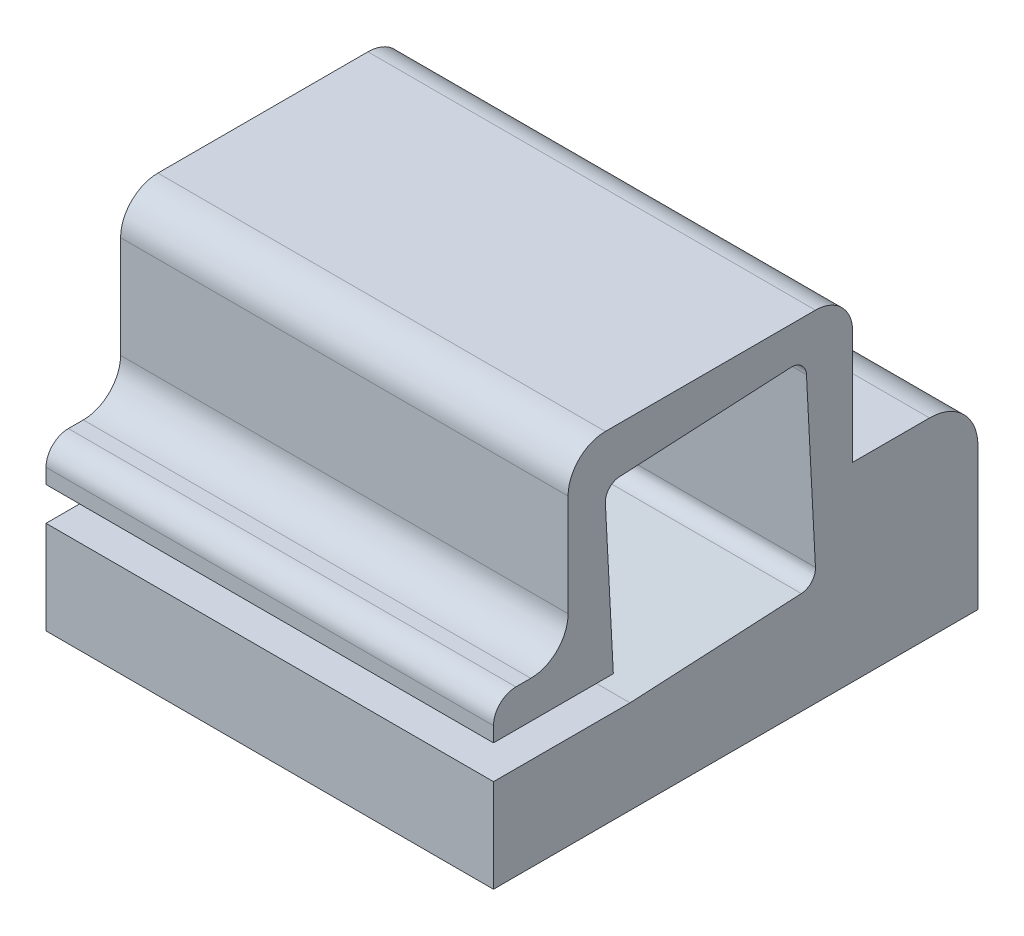
ISO-10303-21;
HEADER;
FILE_DESCRIPTION(('STEP AP214'),'2;1');
FILE_NAME('part.step','',(''),(''),'','','');
FILE_SCHEMA(('AUTOMOTIVE_DESIGN { 1 0 10303 214 1 1 1 1 }'));
ENDSEC;
DATA;
#1=APPLICATION_CONTEXT('core data for automotive mechanical design processes');
#2=APPLICATION_PROTOCOL_DEFINITION('international standard','automotive_design',2000,#1);
#3=PRODUCT_CONTEXT('',#1,'mechanical');
#4=PRODUCT('Part','Part','',(#3));
#5=PRODUCT_RELATED_PRODUCT_CATEGORY('part','',(#4));
#6=PRODUCT_DEFINITION_FORMATION('','',#4);
#7=PRODUCT_DEFINITION_CONTEXT('part definition',#1,'design');
#8=PRODUCT_DEFINITION('design','',#6,#7);
#9=PRODUCT_DEFINITION_SHAPE('','',#8);
#10=(LENGTH_UNIT() NAMED_UNIT(*) SI_UNIT(.MILLI.,.METRE.));
#11=(NAMED_UNIT(*) PLANE_ANGLE_UNIT() SI_UNIT($,.RADIAN.));
#12=(NAMED_UNIT(*) SI_UNIT($,.STERADIAN.) SOLID_ANGLE_UNIT());
#13=UNCERTAINTY_MEASURE_WITH_UNIT(LENGTH_MEASURE(1.E-05),#10,'distance_accuracy_value','');
#14=(GEOMETRIC_REPRESENTATION_CONTEXT(3) GLOBAL_UNCERTAINTY_ASSIGNED_CONTEXT((#13)) GLOBAL_UNIT_ASSIGNED_CONTEXT((#10,
#11,#12)) REPRESENTATION_CONTEXT('',''));
#15=CARTESIAN_POINT('',(0.,0.,0.));
#16=DIRECTION('',(0.,0.,1.));
#17=DIRECTION('',(1.,0.,0.));
#18=AXIS2_PLACEMENT_3D('',#15,#16,#17);
#19=CARTESIAN_POINT('',(60.,-26.58,-35.8784534922355));
#20=DIRECTION('',(0.,1.,0.));
#21=DIRECTION('',(0.,0.,1.));
#22=AXIS2_PLACEMENT_3D('',#19,#20,#21);
#23=PLANE('',#22);
#24=DIRECTION('',(0.,0.,-1.));
#25=VECTOR('',#24,1.);
#26=CARTESIAN_POINT('',(0.,-26.58,-35.8784534922355));
#27=LINE('',#26,#25);
#28=CARTESIAN_POINT('',(0.,-26.58,29.0833622159806));
#29=VERTEX_POINT('',#28);
#30=CARTESIAN_POINT('',(0.,-26.58,-35.8784534922355));
#31=VERTEX_POINT('',#30);
#32=EDGE_CURVE('E221',#29,#31,#27,.T.);
#33=ORIENTED_EDGE('',*,*,#32,.T.);
#34=DIRECTION('',(-1.,0.,0.));
#35=VECTOR('',#34,1.);
#36=CARTESIAN_POINT('',(60.,-26.58,-35.8784534922355));
#37=LINE('',#36,#35);
#38=CARTESIAN_POINT('',(60.,-26.58,-35.8784534922355));
#39=VERTEX_POINT('',#38);
#40=EDGE_CURVE('E11',#39,#31,#37,.T.);
#41=ORIENTED_EDGE('',*,*,#40,.F.);
#42=DIRECTION('',(0.,0.,-1.));
#43=VECTOR('',#42,1.);
#44=CARTESIAN_POINT('',(60.,-26.58,-35.8784534922355));
#45=LINE('',#44,#43);
#46=CARTESIAN_POINT('',(60.,-26.58,29.0833622159806));
#47=VERTEX_POINT('',#46);
#48=EDGE_CURVE('E265',#47,#39,#45,.T.);
#49=ORIENTED_EDGE('',*,*,#48,.F.);
#50=DIRECTION('',(-1.,0.,0.));
#51=VECTOR('',#50,1.);
#52=CARTESIAN_POINT('',(60.,-26.58,29.0833622159806));
#53=LINE('',#52,#51);
#54=EDGE_CURVE('E217',#47,#29,#53,.T.);
#55=ORIENTED_EDGE('',*,*,#54,.T.);
#56=EDGE_LOOP('',(#33,#41,#49,#55));
#57=FACE_BOUND('',#56,.T.);
#58=ADVANCED_FACE('F35',(#57),#23,.F.);
#59=CARTESIAN_POINT('',(60.,-7.57999999999994,-35.8784534922355));
#60=DIRECTION('',(0.,0.,1.));
#61=DIRECTION('',(1.,0.,0.));
#62=AXIS2_PLACEMENT_3D('',#59,#60,#61);
#63=PLANE('',#62);
#64=DIRECTION('',(0.,1.,0.));
#65=VECTOR('',#64,1.);
#66=CARTESIAN_POINT('',(0.,-7.57999999999994,-35.8784534922355));
#67=LINE('',#66,#65);
#68=CARTESIAN_POINT('',(0.,-7.57999999999994,-35.8784534922355));
#69=VERTEX_POINT('',#68);
#70=EDGE_CURVE('E224',#31,#69,#67,.T.);
#71=ORIENTED_EDGE('',*,*,#70,.T.);
#72=DIRECTION('',(-1.,0.,0.));
#73=VECTOR('',#72,1.);
#74=CARTESIAN_POINT('',(60.,-7.57999999999994,-35.8784534922355));
#75=LINE('',#74,#73);
#76=CARTESIAN_POINT('',(60.,-7.57999999999994,-35.8784534922355));
#77=VERTEX_POINT('',#76);
#78=EDGE_CURVE('E43',#77,#69,#75,.T.);
#79=ORIENTED_EDGE('',*,*,#78,.F.);
#80=DIRECTION('',(0.,1.,0.));
#81=VECTOR('',#80,1.);
#82=CARTESIAN_POINT('',(60.,-7.57999999999994,-35.8784534922355));
#83=LINE('',#82,#81);
#84=EDGE_CURVE('E139',#39,#77,#83,.T.);
#85=ORIENTED_EDGE('',*,*,#84,.F.);
#86=ORIENTED_EDGE('',*,*,#40,.T.);
#87=EDGE_LOOP('',(#71,#79,#85,#86));
#88=FACE_BOUND('',#87,.T.);
#89=ADVANCED_FACE('F398',(#88),#63,.F.);
#90=CARTESIAN_POINT('',(60.,-7.57999999999994,-29.3784534922355));
#91=DIRECTION('',(-1.,0.,0.));
#92=DIRECTION('',(0.,0.,1.));
#93=AXIS2_PLACEMENT_3D('',#90,#91,#92);
#94=CYLINDRICAL_SURFACE('',#93,6.50000000000006);
#95=CARTESIAN_POINT('',(0.,-7.57999999999994,-29.3784534922355));
#96=DIRECTION('',(1.,0.,0.));
#97=DIRECTION('',(0.,0.,1.));
#98=AXIS2_PLACEMENT_3D('',#95,#96,#97);
#99=CIRCLE('',#98,6.50000000000006);
#100=CARTESIAN_POINT('',(0.,-1.07999999999988,-29.3784534922355));
#101=VERTEX_POINT('',#100);
#102=EDGE_CURVE('E226',#69,#101,#99,.T.);
#103=ORIENTED_EDGE('',*,*,#102,.T.);
#104=DIRECTION('',(-1.,0.,0.));
#105=VECTOR('',#104,1.);
#106=CARTESIAN_POINT('',(60.,-1.07999999999988,-29.3784534922355));
#107=LINE('',#106,#105);
#108=CARTESIAN_POINT('',(60.,-1.07999999999988,-29.3784534922355));
#109=VERTEX_POINT('',#108);
#110=EDGE_CURVE('E317',#109,#101,#107,.T.);
#111=ORIENTED_EDGE('',*,*,#110,.F.);
#112=CARTESIAN_POINT('',(60.,-7.57999999999994,-29.3784534922355));
#113=DIRECTION('',(1.,0.,0.));
#114=DIRECTION('',(0.,0.,1.));
#115=AXIS2_PLACEMENT_3D('',#112,#113,#114);
#116=CIRCLE('',#115,6.50000000000006);
#117=EDGE_CURVE('E325',#77,#109,#116,.T.);
#118=ORIENTED_EDGE('',*,*,#117,.F.);
#119=ORIENTED_EDGE('',*,*,#78,.T.);
#120=EDGE_LOOP('',(#103,#111,#118,#119));
#121=FACE_BOUND('',#120,.T.);
#122=ADVANCED_FACE('F323',(#121),#94,.T.);
#123=CARTESIAN_POINT('',(60.,-1.07999999999988,-19.0833622159806));
#124=DIRECTION('',(0.,-1.,0.));
#125=DIRECTION('',(0.,0.,-1.));
#126=AXIS2_PLACEMENT_3D('',#123,#124,#125);
#127=PLANE('',#126);
#128=DIRECTION('',(0.,0.,1.));
#129=VECTOR('',#128,1.);
#130=CARTESIAN_POINT('',(0.,-1.07999999999988,-19.0833622159806));
#131=LINE('',#130,#129);
#132=CARTESIAN_POINT('',(0.,-1.07999999999988,-19.0833622159806));
#133=VERTEX_POINT('',#132);
#134=EDGE_CURVE('E228',#101,#133,#131,.T.);
#135=ORIENTED_EDGE('',*,*,#134,.T.);
#136=DIRECTION('',(-1.,0.,0.));
#137=VECTOR('',#136,1.);
#138=CARTESIAN_POINT('',(60.,-1.07999999999988,-19.0833622159806));
#139=LINE('',#138,#137);
#140=CARTESIAN_POINT('',(60.,-1.07999999999988,-19.0833622159806));
#141=VERTEX_POINT('',#140);
#142=EDGE_CURVE('E314',#141,#133,#139,.T.);
#143=ORIENTED_EDGE('',*,*,#142,.F.);
#144=DIRECTION('',(0.,0.,1.));
#145=VECTOR('',#144,1.);
#146=CARTESIAN_POINT('',(60.,-1.07999999999988,-19.0833622159806));
#147=LINE('',#146,#145);
#148=EDGE_CURVE('E343',#109,#141,#147,.T.);
#149=ORIENTED_EDGE('',*,*,#148,.F.);
#150=ORIENTED_EDGE('',*,*,#110,.T.);
#151=EDGE_LOOP('',(#135,#143,#149,#150));
#152=FACE_BOUND('',#151,.T.);
#153=ADVANCED_FACE('F334',(#152),#127,.F.);
#154=CARTESIAN_POINT('',(60.,14.0833622159806,-19.0833622159806));
#155=DIRECTION('',(0.,0.,1.));
#156=DIRECTION('',(1.,0.,0.));
#157=AXIS2_PLACEMENT_3D('',#154,#155,#156);
#158=PLANE('',#157);
#159=DIRECTION('',(0.,1.,0.));
#160=VECTOR('',#159,1.);
#161=CARTESIAN_POINT('',(0.,14.0833622159806,-19.0833622159806));
#162=LINE('',#161,#160);
#163=CARTESIAN_POINT('',(0.,14.0833622159806,-19.0833622159806));
#164=VERTEX_POINT('',#163);
#165=EDGE_CURVE('E230',#133,#164,#162,.T.);
#166=ORIENTED_EDGE('',*,*,#165,.T.);
#167=DIRECTION('',(-1.,0.,0.));
#168=VECTOR('',#167,1.);
#169=CARTESIAN_POINT('',(60.,14.0833622159806,-19.0833622159806));
#170=LINE('',#169,#168);
#171=CARTESIAN_POINT('',(60.,14.0833622159806,-19.0833622159806));
#172=VERTEX_POINT('',#171);
#173=EDGE_CURVE('E311',#172,#164,#170,.T.);
#174=ORIENTED_EDGE('',*,*,#173,.F.);
#175=DIRECTION('',(0.,1.,0.));
#176=VECTOR('',#175,1.);
#177=CARTESIAN_POINT('',(60.,14.0833622159806,-19.0833622159806));
#178=LINE('',#177,#176);
#179=EDGE_CURVE('E340',#141,#172,#178,.T.);
#180=ORIENTED_EDGE('',*,*,#179,.F.);
#181=ORIENTED_EDGE('',*,*,#142,.T.);
#182=EDGE_LOOP('',(#166,#174,#180,#181));
#183=FACE_BOUND('',#182,.T.);
#184=ADVANCED_FACE('F338',(#183),#158,.F.);
#185=CARTESIAN_POINT('',(60.,14.0833622159806,-14.0833622159806));
#186=DIRECTION('',(-1.,0.,0.));
#187=DIRECTION('',(0.,0.,1.));
#188=AXIS2_PLACEMENT_3D('',#185,#186,#187);
#189=CYLINDRICAL_SURFACE('',#188,5.);
#190=CARTESIAN_POINT('',(0.,14.0833622159806,-14.0833622159806));
#191=DIRECTION('',(1.,0.,0.));
#192=DIRECTION('',(0.,0.,1.));
#193=AXIS2_PLACEMENT_3D('',#190,#191,#192);
#194=CIRCLE('',#193,5.);
#195=CARTESIAN_POINT('',(0.,19.0833622159806,-14.0833622159806));
#196=VERTEX_POINT('',#195);
#197=EDGE_CURVE('E232',#164,#196,#194,.T.);
#198=ORIENTED_EDGE('',*,*,#197,.T.);
#199=DIRECTION('',(-1.,0.,0.));
#200=VECTOR('',#199,1.);
#201=CARTESIAN_POINT('',(60.,19.0833622159806,-14.0833622159806));
#202=LINE('',#201,#200);
#203=CARTESIAN_POINT('',(60.,19.0833622159806,-14.0833622159806));
#204=VERTEX_POINT('',#203);
#205=EDGE_CURVE('E308',#204,#196,#202,.T.);
#206=ORIENTED_EDGE('',*,*,#205,.F.);
#207=CARTESIAN_POINT('',(60.,14.0833622159806,-14.0833622159806));
#208=DIRECTION('',(1.,0.,0.));
#209=DIRECTION('',(0.,0.,1.));
#210=AXIS2_PLACEMENT_3D('',#207,#208,#209);
#211=CIRCLE('',#210,5.);
#212=EDGE_CURVE('E342',#172,#204,#211,.T.);
#213=ORIENTED_EDGE('',*,*,#212,.F.);
#214=ORIENTED_EDGE('',*,*,#173,.T.);
#215=EDGE_LOOP('',(#198,#206,#213,#214));
#216=FACE_BOUND('',#215,.T.);
#217=ADVANCED_FACE('F411',(#216),#189,.T.);
#218=CARTESIAN_POINT('',(60.,19.0833622159806,14.0833622159806));
#219=DIRECTION('',(0.,-1.,0.));
#220=DIRECTION('',(0.,0.,-1.));
#221=AXIS2_PLACEMENT_3D('',#218,#219,#220);
#222=PLANE('',#221);
#223=DIRECTION('',(0.,0.,1.));
#224=VECTOR('',#223,1.);
#225=CARTESIAN_POINT('',(0.,19.0833622159806,14.0833622159806));
#226=LINE('',#225,#224);
#227=CARTESIAN_POINT('',(0.,19.0833622159806,14.0833622159806));
#228=VERTEX_POINT('',#227);
#229=EDGE_CURVE('E234',#196,#228,#226,.T.);
#230=ORIENTED_EDGE('',*,*,#229,.T.);
#231=DIRECTION('',(-1.,0.,0.));
#232=VECTOR('',#231,1.);
#233=CARTESIAN_POINT('',(60.,19.0833622159806,14.0833622159806));
#234=LINE('',#233,#232);
#235=CARTESIAN_POINT('',(60.,19.0833622159806,14.0833622159806));
#236=VERTEX_POINT('',#235);
#237=EDGE_CURVE('E305',#236,#228,#234,.T.);
#238=ORIENTED_EDGE('',*,*,#237,.F.);
#239=DIRECTION('',(0.,0.,1.));
#240=VECTOR('',#239,1.);
#241=CARTESIAN_POINT('',(60.,19.0833622159806,14.0833622159806));
#242=LINE('',#241,#240);
#243=EDGE_CURVE('E345',#204,#236,#242,.T.);
#244=ORIENTED_EDGE('',*,*,#243,.F.);
#245=ORIENTED_EDGE('',*,*,#205,.T.);
#246=EDGE_LOOP('',(#230,#238,#244,#245));
#247=FACE_BOUND('',#246,.T.);
#248=ADVANCED_FACE('F414',(#247),#222,.F.);
#249=CARTESIAN_POINT('',(60.,14.0833622159806,14.0833622159806));
#250=DIRECTION('',(-1.,0.,0.));
#251=DIRECTION('',(0.,0.,1.));
#252=AXIS2_PLACEMENT_3D('',#249,#250,#251);
#253=CYLINDRICAL_SURFACE('',#252,5.);
#254=CARTESIAN_POINT('',(0.,14.0833622159806,14.0833622159806));
#255=DIRECTION('',(1.,0.,0.));
#256=DIRECTION('',(0.,0.,-1.));
#257=AXIS2_PLACEMENT_3D('',#254,#255,#256);
#258=CIRCLE('',#257,5.);
#259=CARTESIAN_POINT('',(0.,14.0833622159806,19.0833622159806));
#260=VERTEX_POINT('',#259);
#261=EDGE_CURVE('E236',#228,#260,#258,.T.);
#262=ORIENTED_EDGE('',*,*,#261,.T.);
#263=DIRECTION('',(-1.,0.,0.));
#264=VECTOR('',#263,1.);
#265=CARTESIAN_POINT('',(60.,14.0833622159806,19.0833622159806));
#266=LINE('',#265,#264);
#267=CARTESIAN_POINT('',(60.,14.0833622159806,19.0833622159806));
#268=VERTEX_POINT('',#267);
#269=EDGE_CURVE('E302',#268,#260,#266,.T.);
#270=ORIENTED_EDGE('',*,*,#269,.F.);
#271=CARTESIAN_POINT('',(60.,14.0833622159806,14.0833622159806));
#272=DIRECTION('',(1.,0.,0.));
#273=DIRECTION('',(0.,0.,-1.));
#274=AXIS2_PLACEMENT_3D('',#271,#272,#273);
#275=CIRCLE('',#274,5.);
#276=EDGE_CURVE('E351',#236,#268,#275,.T.);
#277=ORIENTED_EDGE('',*,*,#276,.F.);
#278=ORIENTED_EDGE('',*,*,#237,.T.);
#279=EDGE_LOOP('',(#262,#270,#277,#278));
#280=FACE_BOUND('',#279,.T.);
#281=ADVANCED_FACE('F418',(#280),#253,.T.);
#282=CARTESIAN_POINT('',(60.,0.420000000000007,19.0833622159806));
#283=DIRECTION('',(0.,0.,-1.));
#284=DIRECTION('',(-1.,0.,0.));
#285=AXIS2_PLACEMENT_3D('',#282,#283,#284);
#286=PLANE('',#285);
#287=DIRECTION('',(0.,-1.,0.));
#288=VECTOR('',#287,1.);
#289=CARTESIAN_POINT('',(0.,0.420000000000007,19.0833622159806));
#290=LINE('',#289,#288);
#291=CARTESIAN_POINT('',(0.,0.420000000000007,19.0833622159806));
#292=VERTEX_POINT('',#291);
#293=EDGE_CURVE('E238',#260,#292,#290,.T.);
#294=ORIENTED_EDGE('',*,*,#293,.T.);
#295=DIRECTION('',(-1.,0.,0.));
#296=VECTOR('',#295,1.);
#297=CARTESIAN_POINT('',(60.,0.420000000000007,19.0833622159806));
#298=LINE('',#297,#296);
#299=CARTESIAN_POINT('',(60.,0.420000000000007,19.0833622159806));
#300=VERTEX_POINT('',#299);
#301=EDGE_CURVE('E299',#300,#292,#298,.T.);
#302=ORIENTED_EDGE('',*,*,#301,.F.);
#303=DIRECTION('',(0.,-1.,0.));
#304=VECTOR('',#303,1.);
#305=CARTESIAN_POINT('',(60.,0.420000000000007,19.0833622159806));
#306=LINE('',#305,#304);
#307=EDGE_CURVE('E353',#268,#300,#306,.T.);
#308=ORIENTED_EDGE('',*,*,#307,.F.);
#309=ORIENTED_EDGE('',*,*,#269,.T.);
#310=EDGE_LOOP('',(#294,#302,#308,#309));
#311=FACE_BOUND('',#310,.T.);
#312=ADVANCED_FACE('F422',(#311),#286,.F.);
#313=CARTESIAN_POINT('',(60.,0.420000000000005,24.0833622159806));
#314=DIRECTION('',(-1.,0.,0.));
#315=DIRECTION('',(0.,0.,1.));
#316=AXIS2_PLACEMENT_3D('',#313,#314,#315);
#317=CYLINDRICAL_SURFACE('',#316,5.);
#318=CARTESIAN_POINT('',(0.,0.420000000000005,24.0833622159806));
#319=DIRECTION('',(-1.,0.,0.));
#320=DIRECTION('',(0.,0.,-1.));
#321=AXIS2_PLACEMENT_3D('',#318,#319,#320);
#322=CIRCLE('',#321,5.);
#323=CARTESIAN_POINT('',(0.,-4.58,24.0833622159806));
#324=VERTEX_POINT('',#323);
#325=EDGE_CURVE('E240',#292,#324,#322,.T.);
#326=ORIENTED_EDGE('',*,*,#325,.T.);
#327=DIRECTION('',(-1.,0.,0.));
#328=VECTOR('',#327,1.);
#329=CARTESIAN_POINT('',(60.,-4.58,24.0833622159806));
#330=LINE('',#329,#328);
#331=CARTESIAN_POINT('',(60.,-4.58,24.0833622159806));
#332=VERTEX_POINT('',#331);
#333=EDGE_CURVE('E296',#332,#324,#330,.T.);
#334=ORIENTED_EDGE('',*,*,#333,.F.);
#335=CARTESIAN_POINT('',(60.,0.420000000000005,24.0833622159806));
#336=DIRECTION('',(-1.,0.,0.));
#337=DIRECTION('',(0.,0.,-1.));
#338=AXIS2_PLACEMENT_3D('',#335,#336,#337);
#339=CIRCLE('',#338,5.);
#340=EDGE_CURVE('E355',#300,#332,#339,.T.);
#341=ORIENTED_EDGE('',*,*,#340,.F.);
#342=ORIENTED_EDGE('',*,*,#301,.T.);
#343=EDGE_LOOP('',(#326,#334,#341,#342));
#344=FACE_BOUND('',#343,.T.);
#345=ADVANCED_FACE('F426',(#344),#317,.F.);
#346=CARTESIAN_POINT('',(60.,-4.57999999999999,24.0833622159806));
#347=DIRECTION('',(0.,-1.,0.));
#348=DIRECTION('',(0.,0.,-1.));
#349=AXIS2_PLACEMENT_3D('',#346,#347,#348);
#350=PLANE('',#349);
#351=DIRECTION('',(0.,0.,1.));
#352=VECTOR('',#351,1.);
#353=CARTESIAN_POINT('',(0.,-4.57999999999999,24.0833622159806));
#354=LINE('',#353,#352);
#355=CARTESIAN_POINT('',(0.,-4.58,26.0833622159806));
#356=VERTEX_POINT('',#355);
#357=EDGE_CURVE('E242',#324,#356,#354,.T.);
#358=ORIENTED_EDGE('',*,*,#357,.T.);
#359=DIRECTION('',(-1.,0.,0.));
#360=VECTOR('',#359,1.);
#361=CARTESIAN_POINT('',(60.,-4.58,26.0833622159806));
#362=LINE('',#361,#360);
#363=CARTESIAN_POINT('',(60.,-4.58,26.0833622159806));
#364=VERTEX_POINT('',#363);
#365=EDGE_CURVE('E293',#364,#356,#362,.T.);
#366=ORIENTED_EDGE('',*,*,#365,.F.);
#367=DIRECTION('',(0.,0.,1.));
#368=VECTOR('',#367,1.);
#369=CARTESIAN_POINT('',(60.,-4.57999999999999,24.0833622159806));
#370=LINE('',#369,#368);
#371=EDGE_CURVE('E357',#332,#364,#370,.T.);
#372=ORIENTED_EDGE('',*,*,#371,.F.);
#373=ORIENTED_EDGE('',*,*,#333,.T.);
#374=EDGE_LOOP('',(#358,#366,#372,#373));
#375=FACE_BOUND('',#374,.T.);
#376=ADVANCED_FACE('F430',(#375),#350,.F.);
#377=CARTESIAN_POINT('',(60.,-7.57999999999999,26.0833622159806));
#378=DIRECTION('',(-1.,0.,0.));
#379=DIRECTION('',(0.,0.,1.));
#380=AXIS2_PLACEMENT_3D('',#377,#378,#379);
#381=CYLINDRICAL_SURFACE('',#380,3.);
#382=CARTESIAN_POINT('',(0.,-7.57999999999999,26.0833622159806));
#383=DIRECTION('',(1.,0.,0.));
#384=DIRECTION('',(0.,0.,1.));
#385=AXIS2_PLACEMENT_3D('',#382,#383,#384);
#386=CIRCLE('',#385,3.);
#387=CARTESIAN_POINT('',(0.,-7.57999999999999,29.0833622159806));
#388=VERTEX_POINT('',#387);
#389=EDGE_CURVE('E244',#356,#388,#386,.T.);
#390=ORIENTED_EDGE('',*,*,#389,.T.);
#391=DIRECTION('',(-1.,0.,0.));
#392=VECTOR('',#391,1.);
#393=CARTESIAN_POINT('',(60.,-7.57999999999999,29.0833622159806));
#394=LINE('',#393,#392);
#395=CARTESIAN_POINT('',(60.,-7.57999999999999,29.0833622159806));
#396=VERTEX_POINT('',#395);
#397=EDGE_CURVE('E290',#396,#388,#394,.T.);
#398=ORIENTED_EDGE('',*,*,#397,.F.);
#399=CARTESIAN_POINT('',(60.,-7.57999999999999,26.0833622159806));
#400=DIRECTION('',(1.,0.,0.));
#401=DIRECTION('',(0.,0.,1.));
#402=AXIS2_PLACEMENT_3D('',#399,#400,#401);
#403=CIRCLE('',#402,3.);
#404=EDGE_CURVE('E359',#364,#396,#403,.T.);
#405=ORIENTED_EDGE('',*,*,#404,.F.);
#406=ORIENTED_EDGE('',*,*,#365,.T.);
#407=EDGE_LOOP('',(#390,#398,#405,#406));
#408=FACE_BOUND('',#407,.T.);
#409=ADVANCED_FACE('F434',(#408),#381,.T.);
#410=CARTESIAN_POINT('',(60.,-7.57999999999999,29.0833622159806));
#411=DIRECTION('',(0.,0.,-1.));
#412=DIRECTION('',(0.,1.,0.));
#413=AXIS2_PLACEMENT_3D('',#410,#411,#412);
#414=PLANE('',#413);
#415=DIRECTION('',(0.,-1.,0.));
#416=VECTOR('',#415,1.);
#417=CARTESIAN_POINT('',(0.,-7.57999999999999,29.0833622159806));
#418=LINE('',#417,#416);
#419=CARTESIAN_POINT('',(0.,-9.57999999999999,29.0833622159806));
#420=VERTEX_POINT('',#419);
#421=EDGE_CURVE('E246',#388,#420,#418,.T.);
#422=ORIENTED_EDGE('',*,*,#421,.T.);
#423=DIRECTION('',(-1.,0.,0.));
#424=VECTOR('',#423,1.);
#425=CARTESIAN_POINT('',(60.,-9.57999999999999,29.0833622159806));
#426=LINE('',#425,#424);
#427=CARTESIAN_POINT('',(60.,-9.57999999999999,29.0833622159806));
#428=VERTEX_POINT('',#427);
#429=EDGE_CURVE('E287',#428,#420,#426,.T.);
#430=ORIENTED_EDGE('',*,*,#429,.F.);
#431=DIRECTION('',(0.,-1.,0.));
#432=VECTOR('',#431,1.);
#433=CARTESIAN_POINT('',(60.,-7.57999999999999,29.0833622159806));
#434=LINE('',#433,#432);
#435=EDGE_CURVE('E361',#396,#428,#434,.T.);
#436=ORIENTED_EDGE('',*,*,#435,.F.);
#437=ORIENTED_EDGE('',*,*,#397,.T.);
#438=EDGE_LOOP('',(#422,#430,#436,#437));
#439=FACE_BOUND('',#438,.T.);
#440=ADVANCED_FACE('F438',(#439),#414,.F.);
#441=CARTESIAN_POINT('',(60.,-9.57999999999999,29.0833622159806));
#442=DIRECTION('',(0.,1.,0.));
#443=DIRECTION('',(0.,0.,1.));
#444=AXIS2_PLACEMENT_3D('',#441,#442,#443);
#445=PLANE('',#444);
#446=DIRECTION('',(0.,0.,-1.));
#447=VECTOR('',#446,1.);
#448=CARTESIAN_POINT('',(0.,-9.57999999999999,29.0833622159806));
#449=LINE('',#448,#447);
#450=CARTESIAN_POINT('',(0.,-9.57999999999999,13.0164601454404));
#451=VERTEX_POINT('',#450);
#452=EDGE_CURVE('E248',#420,#451,#449,.T.);
#453=ORIENTED_EDGE('',*,*,#452,.T.);
#454=DIRECTION('',(-1.,0.,0.));
#455=VECTOR('',#454,1.);
#456=CARTESIAN_POINT('',(60.,-9.57999999999999,13.0164601454404));
#457=LINE('',#456,#455);
#458=CARTESIAN_POINT('',(60.,-9.57999999999999,13.0164601454404));
#459=VERTEX_POINT('',#458);
#460=EDGE_CURVE('E284',#459,#451,#457,.T.);
#461=ORIENTED_EDGE('',*,*,#460,.F.);
#462=DIRECTION('',(0.,0.,-1.));
#463=VECTOR('',#462,1.);
#464=CARTESIAN_POINT('',(60.,-9.57999999999999,29.0833622159806));
#465=LINE('',#464,#463);
#466=EDGE_CURVE('E363',#428,#459,#465,.T.);
#467=ORIENTED_EDGE('',*,*,#466,.F.);
#468=ORIENTED_EDGE('',*,*,#429,.T.);
#469=EDGE_LOOP('',(#453,#461,#467,#468));
#470=FACE_BOUND('',#469,.T.);
#471=ADVANCED_FACE('F442',(#470),#445,.F.);
#472=CARTESIAN_POINT('',(60.,10.7777042403978,14.0833622159806));
#473=DIRECTION('',(0.,-0.0523359562429441,0.998629534754574));
#474=DIRECTION('',(0.,-0.998629534754574,-0.0523359562429441));
#475=AXIS2_PLACEMENT_3D('',#472,#473,#474);
#476=PLANE('',#475);
#477=DIRECTION('',(0.,0.998629534754574,0.0523359562429441));
#478=VECTOR('',#477,1.);
#479=CARTESIAN_POINT('',(0.,10.7777042403978,14.0833622159806));
#480=LINE('',#479,#478);
#481=CARTESIAN_POINT('',(0.,10.7777042403978,14.0833622159806));
#482=VERTEX_POINT('',#481);
#483=EDGE_CURVE('E250',#451,#482,#480,.T.);
#484=ORIENTED_EDGE('',*,*,#483,.T.);
#485=DIRECTION('',(-1.,0.,0.));
#486=VECTOR('',#485,1.);
#487=CARTESIAN_POINT('',(60.,10.7777042403978,14.0833622159806));
#488=LINE('',#487,#486);
#489=CARTESIAN_POINT('',(60.,10.7777042403978,14.0833622159806));
#490=VERTEX_POINT('',#489);
#491=EDGE_CURVE('E281',#490,#482,#488,.T.);
#492=ORIENTED_EDGE('',*,*,#491,.F.);
#493=DIRECTION('',(0.,0.998629534754574,0.0523359562429441));
#494=VECTOR('',#493,1.);
#495=CARTESIAN_POINT('',(60.,10.7777042403978,14.0833622159806));
#496=LINE('',#495,#494);
#497=EDGE_CURVE('E365',#459,#490,#496,.T.);
#498=ORIENTED_EDGE('',*,*,#497,.F.);
#499=ORIENTED_EDGE('',*,*,#460,.T.);
#500=EDGE_LOOP('',(#484,#492,#498,#499));
#501=FACE_BOUND('',#500,.T.);
#502=ADVANCED_FACE('F446',(#501),#476,.F.);
#503=CARTESIAN_POINT('',(60.,10.8823761528837,12.0861031464715));
#504=DIRECTION('',(-1.,0.,0.));
#505=DIRECTION('',(0.,0.,1.));
#506=AXIS2_PLACEMENT_3D('',#503,#504,#505);
#507=CYLINDRICAL_SURFACE('',#506,2.);
#508=CARTESIAN_POINT('',(0.,10.8823761528837,12.0861031464715));
#509=DIRECTION('',(-1.,0.,0.));
#510=DIRECTION('',(0.,0.,-1.));
#511=AXIS2_PLACEMENT_3D('',#508,#509,#510);
#512=CIRCLE('',#511,2.);
#513=CARTESIAN_POINT('',(0.,12.8796352223929,12.1907750589574));
#514=VERTEX_POINT('',#513);
#515=EDGE_CURVE('E252',#482,#514,#512,.T.);
#516=ORIENTED_EDGE('',*,*,#515,.T.);
#517=DIRECTION('',(-1.,0.,0.));
#518=VECTOR('',#517,1.);
#519=CARTESIAN_POINT('',(60.,12.8796352223929,12.1907750589574));
#520=LINE('',#519,#518);
#521=CARTESIAN_POINT('',(60.,12.8796352223929,12.1907750589574));
#522=VERTEX_POINT('',#521);
#523=EDGE_CURVE('E278',#522,#514,#520,.T.);
#524=ORIENTED_EDGE('',*,*,#523,.F.);
#525=CARTESIAN_POINT('',(60.,10.8823761528837,12.0861031464715));
#526=DIRECTION('',(-1.,0.,0.));
#527=DIRECTION('',(0.,0.,-1.));
#528=AXIS2_PLACEMENT_3D('',#525,#526,#527);
#529=CIRCLE('',#528,2.);
#530=EDGE_CURVE('E367',#490,#522,#529,.T.);
#531=ORIENTED_EDGE('',*,*,#530,.F.);
#532=ORIENTED_EDGE('',*,*,#491,.T.);
#533=EDGE_LOOP('',(#516,#524,#531,#532));
#534=FACE_BOUND('',#533,.T.);
#535=ADVANCED_FACE('F450',(#534),#507,.F.);
#536=CARTESIAN_POINT('',(60.,14.0833622159806,-10.7777042403978));
#537=DIRECTION('',(0.,0.998629534754574,0.052335956242944));
#538=DIRECTION('',(0.,-0.052335956242944,0.998629534754574));
#539=AXIS2_PLACEMENT_3D('',#536,#537,#538);
#540=PLANE('',#539);
#541=DIRECTION('',(0.,0.052335956242944,-0.998629534754574));
#542=VECTOR('',#541,1.);
#543=CARTESIAN_POINT('',(0.,14.0833622159806,-10.7777042403978));
#544=LINE('',#543,#542);
#545=CARTESIAN_POINT('',(0.,14.0833622159806,-10.7777042403978));
#546=VERTEX_POINT('',#545);
#547=EDGE_CURVE('E254',#514,#546,#544,.T.);
#548=ORIENTED_EDGE('',*,*,#547,.T.);
#549=DIRECTION('',(-1.,0.,0.));
#550=VECTOR('',#549,1.);
#551=CARTESIAN_POINT('',(60.,14.0833622159806,-10.7777042403978));
#552=LINE('',#551,#550);
#553=CARTESIAN_POINT('',(60.,14.0833622159806,-10.7777042403978));
#554=VERTEX_POINT('',#553);
#555=EDGE_CURVE('E275',#554,#546,#552,.T.);
#556=ORIENTED_EDGE('',*,*,#555,.F.);
#557=DIRECTION('',(0.,0.052335956242944,-0.998629534754574));
#558=VECTOR('',#557,1.);
#559=CARTESIAN_POINT('',(60.,14.0833622159806,-10.7777042403978));
#560=LINE('',#559,#558);
#561=EDGE_CURVE('E369',#522,#554,#560,.T.);
#562=ORIENTED_EDGE('',*,*,#561,.F.);
#563=ORIENTED_EDGE('',*,*,#523,.T.);
#564=EDGE_LOOP('',(#548,#556,#562,#563));
#565=FACE_BOUND('',#564,.T.);
#566=ADVANCED_FACE('F454',(#565),#540,.F.);
#567=CARTESIAN_POINT('',(60.,12.0861031464714,-10.8823761528837));
#568=DIRECTION('',(-1.,0.,0.));
#569=DIRECTION('',(0.,0.,1.));
#570=AXIS2_PLACEMENT_3D('',#567,#568,#569);
#571=CYLINDRICAL_SURFACE('',#570,2.);
#572=CARTESIAN_POINT('',(0.,12.0861031464714,-10.8823761528837));
#573=DIRECTION('',(-1.,0.,0.));
#574=DIRECTION('',(0.,0.,-1.));
#575=AXIS2_PLACEMENT_3D('',#572,#573,#574);
#576=CIRCLE('',#575,2.);
#577=CARTESIAN_POINT('',(0.,12.1907750589573,-12.8796352223929));
#578=VERTEX_POINT('',#577);
#579=EDGE_CURVE('E256',#546,#578,#576,.T.);
#580=ORIENTED_EDGE('',*,*,#579,.T.);
#581=DIRECTION('',(-1.,0.,0.));
#582=VECTOR('',#581,1.);
#583=CARTESIAN_POINT('',(60.,12.1907750589573,-12.8796352223929));
#584=LINE('',#583,#582);
#585=CARTESIAN_POINT('',(60.,12.1907750589573,-12.8796352223929));
#586=VERTEX_POINT('',#585);
#587=EDGE_CURVE('E272',#586,#578,#584,.T.);
#588=ORIENTED_EDGE('',*,*,#587,.F.);
#589=CARTESIAN_POINT('',(60.,12.0861031464714,-10.8823761528837));
#590=DIRECTION('',(-1.,0.,0.));
#591=DIRECTION('',(0.,0.,-1.));
#592=AXIS2_PLACEMENT_3D('',#589,#590,#591);
#593=CIRCLE('',#592,2.);
#594=EDGE_CURVE('E371',#554,#586,#593,.T.);
#595=ORIENTED_EDGE('',*,*,#594,.F.);
#596=ORIENTED_EDGE('',*,*,#555,.T.);
#597=EDGE_LOOP('',(#580,#588,#595,#596));
#598=FACE_BOUND('',#597,.T.);
#599=ADVANCED_FACE('F458',(#598),#571,.F.);
#600=CARTESIAN_POINT('',(60.,-10.7777042403979,-14.0833622159806));
#601=DIRECTION('',(0.,0.0523359562429441,-0.998629534754574));
#602=DIRECTION('',(0.,0.998629534754574,0.0523359562429441));
#603=AXIS2_PLACEMENT_3D('',#600,#601,#602);
#604=PLANE('',#603);
#605=DIRECTION('',(0.,-0.998629534754574,-0.0523359562429441));
#606=VECTOR('',#605,1.);
#607=CARTESIAN_POINT('',(0.,-10.7777042403979,-14.0833622159806));
#608=LINE('',#607,#606);
#609=CARTESIAN_POINT('',(0.,-10.7777042403979,-14.0833622159806));
#610=VERTEX_POINT('',#609);
#611=EDGE_CURVE('E258',#578,#610,#608,.T.);
#612=ORIENTED_EDGE('',*,*,#611,.T.);
#613=DIRECTION('',(-1.,0.,0.));
#614=VECTOR('',#613,1.);
#615=CARTESIAN_POINT('',(60.,-10.7777042403979,-14.0833622159806));
#616=LINE('',#615,#614);
#617=CARTESIAN_POINT('',(60.,-10.7777042403979,-14.0833622159806));
#618=VERTEX_POINT('',#617);
#619=EDGE_CURVE('E269',#618,#610,#616,.T.);
#620=ORIENTED_EDGE('',*,*,#619,.F.);
#621=DIRECTION('',(0.,-0.998629534754574,-0.0523359562429441));
#622=VECTOR('',#621,1.);
#623=CARTESIAN_POINT('',(60.,-10.7777042403979,-14.0833622159806));
#624=LINE('',#623,#622);
#625=EDGE_CURVE('E373',#586,#618,#624,.T.);
#626=ORIENTED_EDGE('',*,*,#625,.F.);
#627=ORIENTED_EDGE('',*,*,#587,.T.);
#628=EDGE_LOOP('',(#612,#620,#626,#627));
#629=FACE_BOUND('',#628,.T.);
#630=ADVANCED_FACE('F379',(#629),#604,.F.);
#631=CARTESIAN_POINT('',(60.,-10.8823761528838,-12.0861031464714));
#632=DIRECTION('',(-1.,0.,0.));
#633=DIRECTION('',(0.,0.,1.));
#634=AXIS2_PLACEMENT_3D('',#631,#632,#633);
#635=CYLINDRICAL_SURFACE('',#634,2.);
#636=CARTESIAN_POINT('',(0.,-10.8823761528838,-12.0861031464714));
#637=DIRECTION('',(-1.,0.,0.));
#638=DIRECTION('',(0.,0.,-1.));
#639=AXIS2_PLACEMENT_3D('',#636,#637,#638);
#640=CIRCLE('',#639,2.);
#641=CARTESIAN_POINT('',(0.,-12.8796352223929,-12.1907750589573));
#642=VERTEX_POINT('',#641);
#643=EDGE_CURVE('E260',#610,#642,#640,.T.);
#644=ORIENTED_EDGE('',*,*,#643,.T.);
#645=DIRECTION('',(-1.,0.,0.));
#646=VECTOR('',#645,1.);
#647=CARTESIAN_POINT('',(60.,-12.8796352223929,-12.1907750589573));
#648=LINE('',#647,#646);
#649=CARTESIAN_POINT('',(60.,-12.8796352223929,-12.1907750589573));
#650=VERTEX_POINT('',#649);
#651=EDGE_CURVE('E212',#650,#642,#648,.T.);
#652=ORIENTED_EDGE('',*,*,#651,.F.);
#653=CARTESIAN_POINT('',(60.,-10.8823761528838,-12.0861031464714));
#654=DIRECTION('',(-1.,0.,0.));
#655=DIRECTION('',(0.,0.,-1.));
#656=AXIS2_PLACEMENT_3D('',#653,#654,#655);
#657=CIRCLE('',#656,2.);
#658=EDGE_CURVE('E203',#618,#650,#657,.T.);
#659=ORIENTED_EDGE('',*,*,#658,.F.);
#660=ORIENTED_EDGE('',*,*,#619,.T.);
#661=EDGE_LOOP('',(#644,#652,#659,#660));
#662=FACE_BOUND('',#661,.T.);
#663=ADVANCED_FACE('F383',(#662),#635,.F.);
#664=CARTESIAN_POINT('',(60.,-14.0833622159806,10.7777042403979));
#665=DIRECTION('',(0.,-0.998629534754574,-0.0523359562429441));
#666=DIRECTION('',(0.,0.0523359562429441,-0.998629534754574));
#667=AXIS2_PLACEMENT_3D('',#664,#665,#666);
#668=PLANE('',#667);
#669=DIRECTION('',(0.,-0.0523359562429441,0.998629534754574));
#670=VECTOR('',#669,1.);
#671=CARTESIAN_POINT('',(0.,-14.0833622159806,10.7777042403979));
#672=LINE('',#671,#670);
#673=CARTESIAN_POINT('',(0.,-14.0833622159806,10.7777042403979));
#674=VERTEX_POINT('',#673);
#675=EDGE_CURVE('E211',#642,#674,#672,.T.);
#676=ORIENTED_EDGE('',*,*,#675,.T.);
#677=DIRECTION('',(-1.,0.,0.));
#678=VECTOR('',#677,1.);
#679=CARTESIAN_POINT('',(60.,-14.0833622159806,10.7777042403979));
#680=LINE('',#679,#678);
#681=CARTESIAN_POINT('',(60.,-14.0833622159806,10.7777042403979));
#682=VERTEX_POINT('',#681);
#683=EDGE_CURVE('E208',#682,#674,#680,.T.);
#684=ORIENTED_EDGE('',*,*,#683,.F.);
#685=DIRECTION('',(0.,-0.0523359562429441,0.998629534754574));
#686=VECTOR('',#685,1.);
#687=CARTESIAN_POINT('',(60.,-14.0833622159806,10.7777042403979));
#688=LINE('',#687,#686);
#689=EDGE_CURVE('E197',#650,#682,#688,.T.);
#690=ORIENTED_EDGE('',*,*,#689,.F.);
#691=ORIENTED_EDGE('',*,*,#651,.T.);
#692=EDGE_LOOP('',(#676,#684,#690,#691));
#693=FACE_BOUND('',#692,.T.);
#694=ADVANCED_FACE('F209',(#693),#668,.F.);
#695=CARTESIAN_POINT('',(60.,-14.0833622159806,29.0833622159806));
#696=DIRECTION('',(0.,-1.,0.));
#697=DIRECTION('',(0.,0.,-1.));
#698=AXIS2_PLACEMENT_3D('',#695,#696,#697);
#699=PLANE('',#698);
#700=DIRECTION('',(0.,0.,1.));
#701=VECTOR('',#700,1.);
#702=CARTESIAN_POINT('',(0.,-14.0833622159806,29.0833622159806));
#703=LINE('',#702,#701);
#704=CARTESIAN_POINT('',(0.,-14.0833622159806,29.0833622159806));
#705=VERTEX_POINT('',#704);
#706=EDGE_CURVE('E125',#674,#705,#703,.T.);
#707=ORIENTED_EDGE('',*,*,#706,.T.);
#708=DIRECTION('',(-1.,0.,0.));
#709=VECTOR('',#708,1.);
#710=CARTESIAN_POINT('',(60.,-14.0833622159806,29.0833622159806));
#711=LINE('',#710,#709);
#712=CARTESIAN_POINT('',(60.,-14.0833622159806,29.0833622159806));
#713=VERTEX_POINT('',#712);
#714=EDGE_CURVE('E213',#713,#705,#711,.T.);
#715=ORIENTED_EDGE('',*,*,#714,.F.);
#716=DIRECTION('',(0.,0.,1.));
#717=VECTOR('',#716,1.);
#718=CARTESIAN_POINT('',(60.,-14.0833622159806,29.0833622159806));
#719=LINE('',#718,#717);
#720=EDGE_CURVE('E201',#682,#713,#719,.T.);
#721=ORIENTED_EDGE('',*,*,#720,.F.);
#722=ORIENTED_EDGE('',*,*,#683,.T.);
#723=EDGE_LOOP('',(#707,#715,#721,#722));
#724=FACE_BOUND('',#723,.T.);
#725=ADVANCED_FACE('F215',(#724),#699,.F.);
#726=CARTESIAN_POINT('',(60.,-26.58,29.0833622159806));
#727=DIRECTION('',(0.,0.,-1.));
#728=DIRECTION('',(-1.,0.,0.));
#729=AXIS2_PLACEMENT_3D('',#726,#727,#728);
#730=PLANE('',#729);
#731=DIRECTION('',(0.,-1.,0.));
#732=VECTOR('',#731,1.);
#733=CARTESIAN_POINT('',(0.,-26.58,29.0833622159806));
#734=LINE('',#733,#732);
#735=EDGE_CURVE('E131',#705,#29,#734,.T.);
#736=ORIENTED_EDGE('',*,*,#735,.T.);
#737=ORIENTED_EDGE('',*,*,#54,.F.);
#738=DIRECTION('',(0.,-1.,0.));
#739=VECTOR('',#738,1.);
#740=CARTESIAN_POINT('',(60.,-26.58,29.0833622159806));
#741=LINE('',#740,#739);
#742=EDGE_CURVE('E51',#713,#47,#741,.T.);
#743=ORIENTED_EDGE('',*,*,#742,.F.);
#744=ORIENTED_EDGE('',*,*,#714,.T.);
#745=EDGE_LOOP('',(#736,#737,#743,#744));
#746=FACE_BOUND('',#745,.T.);
#747=ADVANCED_FACE('F387',(#746),#730,.F.);
#748=CARTESIAN_POINT('',(60.,-10.8823761528838,-12.0861031464714));
#749=DIRECTION('',(1.,0.,0.));
#750=DIRECTION('',(0.,0.,-1.));
#751=AXIS2_PLACEMENT_3D('',#748,#749,#750);
#752=PLANE('',#751);
#753=ORIENTED_EDGE('',*,*,#48,.T.);
#754=ORIENTED_EDGE('',*,*,#84,.T.);
#755=ORIENTED_EDGE('',*,*,#117,.T.);
#756=ORIENTED_EDGE('',*,*,#148,.T.);
#757=ORIENTED_EDGE('',*,*,#179,.T.);
#758=ORIENTED_EDGE('',*,*,#212,.T.);
#759=ORIENTED_EDGE('',*,*,#243,.T.);
#760=ORIENTED_EDGE('',*,*,#276,.T.);
#761=ORIENTED_EDGE('',*,*,#307,.T.);
#762=ORIENTED_EDGE('',*,*,#340,.T.);
#763=ORIENTED_EDGE('',*,*,#371,.T.);
#764=ORIENTED_EDGE('',*,*,#404,.T.);
#765=ORIENTED_EDGE('',*,*,#435,.T.);
#766=ORIENTED_EDGE('',*,*,#466,.T.);
#767=ORIENTED_EDGE('',*,*,#497,.T.);
#768=ORIENTED_EDGE('',*,*,#530,.T.);
#769=ORIENTED_EDGE('',*,*,#561,.T.);
#770=ORIENTED_EDGE('',*,*,#594,.T.);
#771=ORIENTED_EDGE('',*,*,#625,.T.);
#772=ORIENTED_EDGE('',*,*,#658,.T.);
#773=ORIENTED_EDGE('',*,*,#689,.T.);
#774=ORIENTED_EDGE('',*,*,#720,.T.);
#775=ORIENTED_EDGE('',*,*,#742,.T.);
#776=EDGE_LOOP('',(#753,#754,#755,#756,#757,#758,#759,#760,#761,#762,#763,#764,#765,#766,#767,
#768,#769,#770,#771,#772,#773,#774,#775));
#777=FACE_BOUND('',#776,.T.);
#778=ADVANCED_FACE('F199',(#777),#752,.T.);
#779=CARTESIAN_POINT('',(0.,-10.8823761528838,-12.0861031464714));
#780=DIRECTION('',(1.,0.,0.));
#781=DIRECTION('',(0.,0.,-1.));
#782=AXIS2_PLACEMENT_3D('',#779,#780,#781);
#783=PLANE('',#782);
#784=ORIENTED_EDGE('',*,*,#32,.F.);
#785=ORIENTED_EDGE('',*,*,#735,.F.);
#786=ORIENTED_EDGE('',*,*,#706,.F.);
#787=ORIENTED_EDGE('',*,*,#675,.F.);
#788=ORIENTED_EDGE('',*,*,#643,.F.);
#789=ORIENTED_EDGE('',*,*,#611,.F.);
#790=ORIENTED_EDGE('',*,*,#579,.F.);
#791=ORIENTED_EDGE('',*,*,#547,.F.);
#792=ORIENTED_EDGE('',*,*,#515,.F.);
#793=ORIENTED_EDGE('',*,*,#483,.F.);
#794=ORIENTED_EDGE('',*,*,#452,.F.);
#795=ORIENTED_EDGE('',*,*,#421,.F.);
#796=ORIENTED_EDGE('',*,*,#389,.F.);
#797=ORIENTED_EDGE('',*,*,#357,.F.);
#798=ORIENTED_EDGE('',*,*,#325,.F.);
#799=ORIENTED_EDGE('',*,*,#293,.F.);
#800=ORIENTED_EDGE('',*,*,#261,.F.);
#801=ORIENTED_EDGE('',*,*,#229,.F.);
#802=ORIENTED_EDGE('',*,*,#197,.F.);
#803=ORIENTED_EDGE('',*,*,#165,.F.);
#804=ORIENTED_EDGE('',*,*,#134,.F.);
#805=ORIENTED_EDGE('',*,*,#102,.F.);
#806=ORIENTED_EDGE('',*,*,#70,.F.);
#807=EDGE_LOOP('',(#784,#785,#786,#787,#788,#789,#790,#791,#792,#793,#794,#795,#796,#797,#798,
#799,#800,#801,#802,#803,#804,#805,#806));
#808=FACE_BOUND('',#807,.T.);
#809=ADVANCED_FACE('F329',(#808),#783,.F.);
#810=CLOSED_SHELL('',(#58,#89,#122,#153,#184,#217,#248,#281,#312,#345,#376,#409,#440,#471,#502,
#535,#566,#599,#630,#663,#694,#725,#747,#778,#809));
#811=MANIFOLD_SOLID_BREP('B2',#810);
#812=ADVANCED_BREP_SHAPE_REPRESENTATION('',(#18,#811),#14);
#813=SHAPE_DEFINITION_REPRESENTATION(#9,#812);
ENDSEC;
END-ISO-10303-21;
